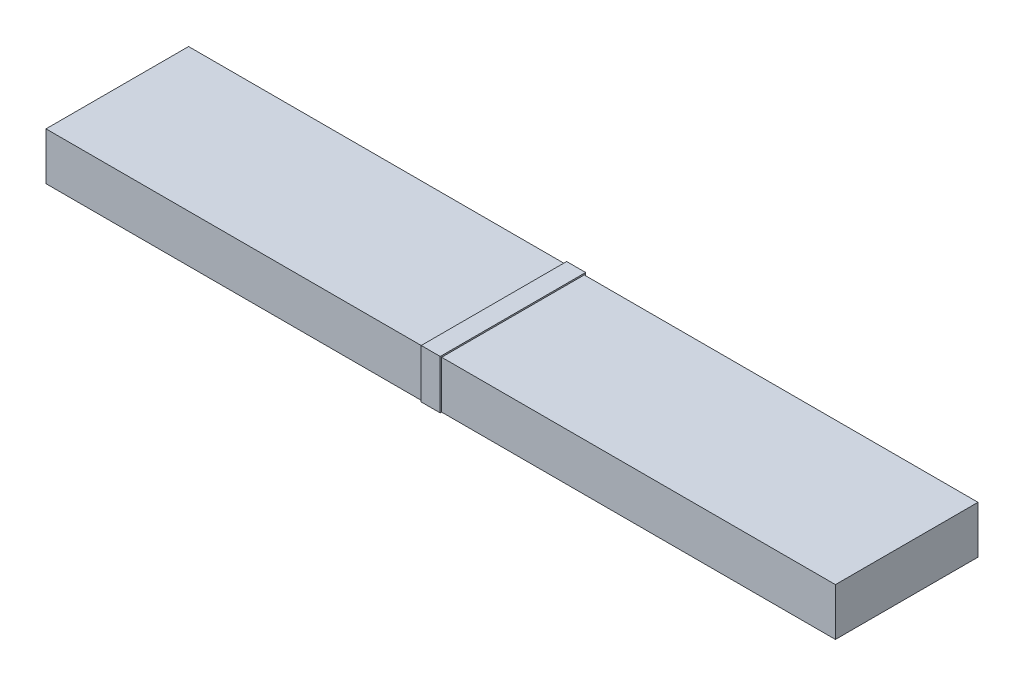
ISO-10303-21;
HEADER;
FILE_DESCRIPTION(('STEP AP214'),'2;1');
FILE_NAME('part.step','',(''),(''),'','','');
FILE_SCHEMA(('AUTOMOTIVE_DESIGN { 1 0 10303 214 1 1 1 1 }'));
ENDSEC;
DATA;
#1=APPLICATION_CONTEXT('core data for automotive mechanical design processes');
#2=APPLICATION_PROTOCOL_DEFINITION('international standard','automotive_design',2000,#1);
#3=PRODUCT_CONTEXT('',#1,'mechanical');
#4=PRODUCT('Part','Part','',(#3));
#5=PRODUCT_RELATED_PRODUCT_CATEGORY('part','',(#4));
#6=PRODUCT_DEFINITION_FORMATION('','',#4);
#7=PRODUCT_DEFINITION_CONTEXT('part definition',#1,'design');
#8=PRODUCT_DEFINITION('design','',#6,#7);
#9=PRODUCT_DEFINITION_SHAPE('','',#8);
#10=(LENGTH_UNIT() NAMED_UNIT(*) SI_UNIT(.MILLI.,.METRE.));
#11=(NAMED_UNIT(*) PLANE_ANGLE_UNIT() SI_UNIT($,.RADIAN.));
#12=(NAMED_UNIT(*) SI_UNIT($,.STERADIAN.) SOLID_ANGLE_UNIT());
#13=UNCERTAINTY_MEASURE_WITH_UNIT(LENGTH_MEASURE(1.E-05),#10,'distance_accuracy_value','');
#14=(GEOMETRIC_REPRESENTATION_CONTEXT(3) GLOBAL_UNCERTAINTY_ASSIGNED_CONTEXT((#13)) GLOBAL_UNIT_ASSIGNED_CONTEXT((#10,
#11,#12)) REPRESENTATION_CONTEXT('',''));
#15=CARTESIAN_POINT('',(0.,0.,0.));
#16=DIRECTION('',(0.,0.,1.));
#17=DIRECTION('',(1.,0.,0.));
#18=AXIS2_PLACEMENT_3D('',#15,#16,#17);
#19=CARTESIAN_POINT('',(-38.,-49.9999999999999,150.));
#20=DIRECTION('',(0.,-1.,0.));
#21=DIRECTION('',(0.,0.,-1.));
#22=AXIS2_PLACEMENT_3D('',#19,#20,#21);
#23=PLANE('',#22);
#24=DIRECTION('',(1.,0.,0.));
#25=VECTOR('',#24,1.);
#26=CARTESIAN_POINT('',(-38.,-49.9999999999999,150.));
#27=LINE('',#26,#25);
#28=CARTESIAN_POINT('',(-38.,-49.9999999999999,150.));
#29=VERTEX_POINT('',#28);
#30=CARTESIAN_POINT('',(2.,-49.9999999999999,150.));
#31=VERTEX_POINT('',#30);
#32=EDGE_CURVE('E48',#29,#31,#27,.T.);
#33=ORIENTED_EDGE('',*,*,#32,.T.);
#34=DIRECTION('',(0.,0.,-1.));
#35=VECTOR('',#34,1.);
#36=CARTESIAN_POINT('',(2.,-49.9999999999999,150.));
#37=LINE('',#36,#35);
#38=CARTESIAN_POINT('',(2.,-49.9999999999999,153.));
#39=VERTEX_POINT('',#38);
#40=EDGE_CURVE('E109',#39,#31,#37,.T.);
#41=ORIENTED_EDGE('',*,*,#40,.F.);
#42=DIRECTION('',(1.,0.,0.));
#43=VECTOR('',#42,1.);
#44=CARTESIAN_POINT('',(-38.,-49.9999999999999,153.));
#45=LINE('',#44,#43);
#46=CARTESIAN_POINT('',(-38.,-49.9999999999999,153.));
#47=VERTEX_POINT('',#46);
#48=EDGE_CURVE('E12',#47,#39,#45,.T.);
#49=ORIENTED_EDGE('',*,*,#48,.F.);
#50=DIRECTION('',(0.,0.,-1.));
#51=VECTOR('',#50,1.);
#52=CARTESIAN_POINT('',(-38.,-49.9999999999999,150.));
#53=LINE('',#52,#51);
#54=EDGE_CURVE('E110',#47,#29,#53,.T.);
#55=ORIENTED_EDGE('',*,*,#54,.T.);
#56=EDGE_LOOP('',(#33,#41,#49,#55));
#57=FACE_BOUND('',#56,.T.);
#58=ADVANCED_FACE('F45',(#57),#23,.T.);
#59=CARTESIAN_POINT('',(-38.,-49.9999999999999,153.));
#60=DIRECTION('',(0.,0.,1.));
#61=DIRECTION('',(1.,0.,0.));
#62=AXIS2_PLACEMENT_3D('',#59,#60,#61);
#63=PLANE('',#62);
#64=ORIENTED_EDGE('',*,*,#48,.T.);
#65=DIRECTION('',(0.,-1.,0.));
#66=VECTOR('',#65,1.);
#67=CARTESIAN_POINT('',(2.,-49.9999999999999,153.));
#68=LINE('',#67,#66);
#69=CARTESIAN_POINT('',(2.,53.,153.));
#70=VERTEX_POINT('',#69);
#71=EDGE_CURVE('E127',#70,#39,#68,.T.);
#72=ORIENTED_EDGE('',*,*,#71,.F.);
#73=DIRECTION('',(1.,0.,0.));
#74=VECTOR('',#73,1.);
#75=CARTESIAN_POINT('',(-38.,53.,153.));
#76=LINE('',#75,#74);
#77=CARTESIAN_POINT('',(-38.,53.,153.));
#78=VERTEX_POINT('',#77);
#79=EDGE_CURVE('E53',#78,#70,#76,.T.);
#80=ORIENTED_EDGE('',*,*,#79,.F.);
#81=DIRECTION('',(0.,-1.,0.));
#82=VECTOR('',#81,1.);
#83=CARTESIAN_POINT('',(-38.,-49.9999999999999,153.));
#84=LINE('',#83,#82);
#85=EDGE_CURVE('E115',#78,#47,#84,.T.);
#86=ORIENTED_EDGE('',*,*,#85,.T.);
#87=EDGE_LOOP('',(#64,#72,#80,#86));
#88=FACE_BOUND('',#87,.T.);
#89=ADVANCED_FACE('F191',(#88),#63,.T.);
#90=CARTESIAN_POINT('',(-38.,53.,153.));
#91=DIRECTION('',(0.,1.,0.));
#92=DIRECTION('',(0.,0.,1.));
#93=AXIS2_PLACEMENT_3D('',#90,#91,#92);
#94=PLANE('',#93);
#95=ORIENTED_EDGE('',*,*,#79,.T.);
#96=DIRECTION('',(0.,0.,1.));
#97=VECTOR('',#96,1.);
#98=CARTESIAN_POINT('',(2.,53.,153.));
#99=LINE('',#98,#97);
#100=CARTESIAN_POINT('',(2.,53.,-153.));
#101=VERTEX_POINT('',#100);
#102=EDGE_CURVE('E140',#101,#70,#99,.T.);
#103=ORIENTED_EDGE('',*,*,#102,.F.);
#104=DIRECTION('',(1.,0.,0.));
#105=VECTOR('',#104,1.);
#106=CARTESIAN_POINT('',(-38.,53.,-153.));
#107=LINE('',#106,#105);
#108=CARTESIAN_POINT('',(-38.,53.,-153.));
#109=VERTEX_POINT('',#108);
#110=EDGE_CURVE('E162',#109,#101,#107,.T.);
#111=ORIENTED_EDGE('',*,*,#110,.F.);
#112=DIRECTION('',(0.,0.,1.));
#113=VECTOR('',#112,1.);
#114=CARTESIAN_POINT('',(-38.,53.,153.));
#115=LINE('',#114,#113);
#116=EDGE_CURVE('E158',#109,#78,#115,.T.);
#117=ORIENTED_EDGE('',*,*,#116,.T.);
#118=EDGE_LOOP('',(#95,#103,#111,#117));
#119=FACE_BOUND('',#118,.T.);
#120=ADVANCED_FACE('F190',(#119),#94,.T.);
#121=CARTESIAN_POINT('',(-38.,53.,-153.));
#122=DIRECTION('',(0.,0.,-1.));
#123=DIRECTION('',(-1.,0.,0.));
#124=AXIS2_PLACEMENT_3D('',#121,#122,#123);
#125=PLANE('',#124);
#126=ORIENTED_EDGE('',*,*,#110,.T.);
#127=DIRECTION('',(0.,1.,0.));
#128=VECTOR('',#127,1.);
#129=CARTESIAN_POINT('',(2.,53.,-153.));
#130=LINE('',#129,#128);
#131=CARTESIAN_POINT('',(2.,-49.9999999999999,-153.));
#132=VERTEX_POINT('',#131);
#133=EDGE_CURVE('E137',#132,#101,#130,.T.);
#134=ORIENTED_EDGE('',*,*,#133,.F.);
#135=DIRECTION('',(1.,0.,0.));
#136=VECTOR('',#135,1.);
#137=CARTESIAN_POINT('',(-38.,-49.9999999999999,-153.));
#138=LINE('',#137,#136);
#139=CARTESIAN_POINT('',(-38.,-49.9999999999999,-153.));
#140=VERTEX_POINT('',#139);
#141=EDGE_CURVE('E164',#140,#132,#138,.T.);
#142=ORIENTED_EDGE('',*,*,#141,.F.);
#143=DIRECTION('',(0.,1.,0.));
#144=VECTOR('',#143,1.);
#145=CARTESIAN_POINT('',(-38.,53.,-153.));
#146=LINE('',#145,#144);
#147=EDGE_CURVE('E155',#140,#109,#146,.T.);
#148=ORIENTED_EDGE('',*,*,#147,.T.);
#149=EDGE_LOOP('',(#126,#134,#142,#148));
#150=FACE_BOUND('',#149,.T.);
#151=ADVANCED_FACE('F186',(#150),#125,.T.);
#152=CARTESIAN_POINT('',(-38.,-49.9999999999999,-150.));
#153=DIRECTION('',(0.,-1.,0.));
#154=DIRECTION('',(0.,0.,-1.));
#155=AXIS2_PLACEMENT_3D('',#152,#153,#154);
#156=PLANE('',#155);
#157=ORIENTED_EDGE('',*,*,#141,.T.);
#158=DIRECTION('',(0.,0.,-1.));
#159=VECTOR('',#158,1.);
#160=CARTESIAN_POINT('',(2.,-49.9999999999999,-150.));
#161=LINE('',#160,#159);
#162=CARTESIAN_POINT('',(2.,-49.9999999999999,-150.));
#163=VERTEX_POINT('',#162);
#164=EDGE_CURVE('E134',#163,#132,#161,.T.);
#165=ORIENTED_EDGE('',*,*,#164,.F.);
#166=DIRECTION('',(1.,0.,0.));
#167=VECTOR('',#166,1.);
#168=CARTESIAN_POINT('',(-38.,-49.9999999999999,-150.));
#169=LINE('',#168,#167);
#170=CARTESIAN_POINT('',(-38.,-49.9999999999999,-150.));
#171=VERTEX_POINT('',#170);
#172=EDGE_CURVE('E166',#171,#163,#169,.T.);
#173=ORIENTED_EDGE('',*,*,#172,.F.);
#174=DIRECTION('',(0.,0.,-1.));
#175=VECTOR('',#174,1.);
#176=CARTESIAN_POINT('',(-38.,-49.9999999999999,-150.));
#177=LINE('',#176,#175);
#178=EDGE_CURVE('E152',#171,#140,#177,.T.);
#179=ORIENTED_EDGE('',*,*,#178,.T.);
#180=EDGE_LOOP('',(#157,#165,#173,#179));
#181=FACE_BOUND('',#180,.T.);
#182=ADVANCED_FACE('F179',(#181),#156,.T.);
#183=CARTESIAN_POINT('',(-38.,50.,-150.));
#184=DIRECTION('',(0.,0.,1.));
#185=DIRECTION('',(1.,0.,0.));
#186=AXIS2_PLACEMENT_3D('',#183,#184,#185);
#187=PLANE('',#186);
#188=ORIENTED_EDGE('',*,*,#172,.T.);
#189=DIRECTION('',(0.,-1.,0.));
#190=VECTOR('',#189,1.);
#191=CARTESIAN_POINT('',(2.,50.,-150.));
#192=LINE('',#191,#190);
#193=CARTESIAN_POINT('',(2.,50.,-150.));
#194=VERTEX_POINT('',#193);
#195=EDGE_CURVE('E131',#194,#163,#192,.T.);
#196=ORIENTED_EDGE('',*,*,#195,.F.);
#197=DIRECTION('',(1.,0.,0.));
#198=VECTOR('',#197,1.);
#199=CARTESIAN_POINT('',(-38.,50.,-150.));
#200=LINE('',#199,#198);
#201=CARTESIAN_POINT('',(-38.,50.,-150.));
#202=VERTEX_POINT('',#201);
#203=EDGE_CURVE('E168',#202,#194,#200,.T.);
#204=ORIENTED_EDGE('',*,*,#203,.F.);
#205=DIRECTION('',(0.,-1.,0.));
#206=VECTOR('',#205,1.);
#207=CARTESIAN_POINT('',(-38.,50.,-150.));
#208=LINE('',#207,#206);
#209=EDGE_CURVE('E149',#202,#171,#208,.T.);
#210=ORIENTED_EDGE('',*,*,#209,.T.);
#211=EDGE_LOOP('',(#188,#196,#204,#210));
#212=FACE_BOUND('',#211,.T.);
#213=ADVANCED_FACE('F176',(#212),#187,.T.);
#214=CARTESIAN_POINT('',(-38.,50.,150.));
#215=DIRECTION('',(0.,-1.,0.));
#216=DIRECTION('',(0.,0.,-1.));
#217=AXIS2_PLACEMENT_3D('',#214,#215,#216);
#218=PLANE('',#217);
#219=ORIENTED_EDGE('',*,*,#203,.T.);
#220=DIRECTION('',(0.,0.,-1.));
#221=VECTOR('',#220,1.);
#222=CARTESIAN_POINT('',(2.,50.,150.));
#223=LINE('',#222,#221);
#224=CARTESIAN_POINT('',(2.,50.,150.));
#225=VERTEX_POINT('',#224);
#226=EDGE_CURVE('E122',#225,#194,#223,.T.);
#227=ORIENTED_EDGE('',*,*,#226,.F.);
#228=DIRECTION('',(1.,0.,0.));
#229=VECTOR('',#228,1.);
#230=CARTESIAN_POINT('',(-38.,50.,150.));
#231=LINE('',#230,#229);
#232=CARTESIAN_POINT('',(-38.,50.,150.));
#233=VERTEX_POINT('',#232);
#234=EDGE_CURVE('E114',#233,#225,#231,.T.);
#235=ORIENTED_EDGE('',*,*,#234,.F.);
#236=DIRECTION('',(0.,0.,-1.));
#237=VECTOR('',#236,1.);
#238=CARTESIAN_POINT('',(-38.,50.,150.));
#239=LINE('',#238,#237);
#240=EDGE_CURVE('E146',#233,#202,#239,.T.);
#241=ORIENTED_EDGE('',*,*,#240,.T.);
#242=EDGE_LOOP('',(#219,#227,#235,#241));
#243=FACE_BOUND('',#242,.T.);
#244=ADVANCED_FACE('F170',(#243),#218,.T.);
#245=CARTESIAN_POINT('',(-38.,-49.9999999999999,150.));
#246=DIRECTION('',(0.,0.,-1.));
#247=DIRECTION('',(-1.,0.,0.));
#248=AXIS2_PLACEMENT_3D('',#245,#246,#247);
#249=PLANE('',#248);
#250=ORIENTED_EDGE('',*,*,#234,.T.);
#251=DIRECTION('',(0.,1.,0.));
#252=VECTOR('',#251,1.);
#253=CARTESIAN_POINT('',(2.,-49.9999999999999,150.));
#254=LINE('',#253,#252);
#255=EDGE_CURVE('E117',#31,#225,#254,.T.);
#256=ORIENTED_EDGE('',*,*,#255,.F.);
#257=ORIENTED_EDGE('',*,*,#32,.F.);
#258=DIRECTION('',(0.,1.,0.));
#259=VECTOR('',#258,1.);
#260=CARTESIAN_POINT('',(-38.,-49.9999999999999,150.));
#261=LINE('',#260,#259);
#262=EDGE_CURVE('E144',#29,#233,#261,.T.);
#263=ORIENTED_EDGE('',*,*,#262,.T.);
#264=EDGE_LOOP('',(#250,#256,#257,#263));
#265=FACE_BOUND('',#264,.T.);
#266=ADVANCED_FACE('F118',(#265),#249,.T.);
#267=CARTESIAN_POINT('',(-38.,0.,0.));
#268=DIRECTION('',(-1.,0.,0.));
#269=DIRECTION('',(0.,0.,1.));
#270=AXIS2_PLACEMENT_3D('',#267,#268,#269);
#271=PLANE('',#270);
#272=ORIENTED_EDGE('',*,*,#54,.F.);
#273=ORIENTED_EDGE('',*,*,#85,.F.);
#274=ORIENTED_EDGE('',*,*,#116,.F.);
#275=ORIENTED_EDGE('',*,*,#147,.F.);
#276=ORIENTED_EDGE('',*,*,#178,.F.);
#277=ORIENTED_EDGE('',*,*,#209,.F.);
#278=ORIENTED_EDGE('',*,*,#240,.F.);
#279=ORIENTED_EDGE('',*,*,#262,.F.);
#280=EDGE_LOOP('',(#272,#273,#274,#275,#276,#277,#278,#279));
#281=FACE_BOUND('',#280,.T.);
#282=ADVANCED_FACE('F182',(#281),#271,.T.);
#283=CARTESIAN_POINT('',(2.,0.,0.));
#284=DIRECTION('',(-1.,0.,0.));
#285=DIRECTION('',(0.,0.,1.));
#286=AXIS2_PLACEMENT_3D('',#283,#284,#285);
#287=PLANE('',#286);
#288=ORIENTED_EDGE('',*,*,#40,.T.);
#289=ORIENTED_EDGE('',*,*,#255,.T.);
#290=ORIENTED_EDGE('',*,*,#226,.T.);
#291=ORIENTED_EDGE('',*,*,#195,.T.);
#292=ORIENTED_EDGE('',*,*,#164,.T.);
#293=ORIENTED_EDGE('',*,*,#133,.T.);
#294=ORIENTED_EDGE('',*,*,#102,.T.);
#295=ORIENTED_EDGE('',*,*,#71,.T.);
#296=EDGE_LOOP('',(#288,#289,#290,#291,#292,#293,#294,#295));
#297=FACE_BOUND('',#296,.T.);
#298=ADVANCED_FACE('F125',(#297),#287,.F.);
#299=CLOSED_SHELL('',(#58,#89,#120,#151,#182,#213,#244,#266,#282,#298));
#300=MANIFOLD_SOLID_BREP('B2',#299);
#301=CARTESIAN_POINT('',(830.5,-50.,-150.));
#302=DIRECTION('',(1.,0.,0.));
#303=DIRECTION('',(0.,0.,-1.));
#304=AXIS2_PLACEMENT_3D('',#301,#302,#303);
#305=PLANE('',#304);
#306=DIRECTION('',(0.,0.,1.));
#307=VECTOR('',#306,1.);
#308=CARTESIAN_POINT('',(830.5,50.,-150.));
#309=LINE('',#308,#307);
#310=CARTESIAN_POINT('',(830.5,50.,-150.));
#311=VERTEX_POINT('',#310);
#312=CARTESIAN_POINT('',(830.5,50.,150.));
#313=VERTEX_POINT('',#312);
#314=EDGE_CURVE('E276',#311,#313,#309,.T.);
#315=ORIENTED_EDGE('',*,*,#314,.T.);
#316=DIRECTION('',(0.,1.,0.));
#317=VECTOR('',#316,1.);
#318=CARTESIAN_POINT('',(830.5,-50.,150.));
#319=LINE('',#318,#317);
#320=CARTESIAN_POINT('',(830.5,-50.,150.));
#321=VERTEX_POINT('',#320);
#322=EDGE_CURVE('E313',#321,#313,#319,.T.);
#323=ORIENTED_EDGE('',*,*,#322,.F.);
#324=DIRECTION('',(0.,0.,1.));
#325=VECTOR('',#324,1.);
#326=CARTESIAN_POINT('',(830.5,-50.,-150.));
#327=LINE('',#326,#325);
#328=CARTESIAN_POINT('',(830.5,-50.,-150.));
#329=VERTEX_POINT('',#328);
#330=EDGE_CURVE('E43',#329,#321,#327,.T.);
#331=ORIENTED_EDGE('',*,*,#330,.F.);
#332=DIRECTION('',(0.,1.,0.));
#333=VECTOR('',#332,1.);
#334=CARTESIAN_POINT('',(830.5,-50.,-150.));
#335=LINE('',#334,#333);
#336=EDGE_CURVE('E314',#329,#311,#335,.T.);
#337=ORIENTED_EDGE('',*,*,#336,.T.);
#338=EDGE_LOOP('',(#315,#323,#331,#337));
#339=FACE_BOUND('',#338,.T.);
#340=ADVANCED_FACE('F273',(#339),#305,.T.);
#341=CARTESIAN_POINT('',(-830.5,-50.,-150.));
#342=DIRECTION('',(0.,-1.,0.));
#343=DIRECTION('',(0.,0.,-1.));
#344=AXIS2_PLACEMENT_3D('',#341,#342,#343);
#345=PLANE('',#344);
#346=ORIENTED_EDGE('',*,*,#330,.T.);
#347=DIRECTION('',(1.,0.,0.));
#348=VECTOR('',#347,1.);
#349=CARTESIAN_POINT('',(-830.5,-50.,150.));
#350=LINE('',#349,#348);
#351=CARTESIAN_POINT('',(-830.5,-50.,150.));
#352=VERTEX_POINT('',#351);
#353=EDGE_CURVE('E330',#352,#321,#350,.T.);
#354=ORIENTED_EDGE('',*,*,#353,.F.);
#355=DIRECTION('',(0.,0.,1.));
#356=VECTOR('',#355,1.);
#357=CARTESIAN_POINT('',(-830.5,-50.,-150.));
#358=LINE('',#357,#356);
#359=CARTESIAN_POINT('',(-830.5,-50.,-150.));
#360=VERTEX_POINT('',#359);
#361=EDGE_CURVE('E281',#360,#352,#358,.T.);
#362=ORIENTED_EDGE('',*,*,#361,.F.);
#363=DIRECTION('',(1.,0.,0.));
#364=VECTOR('',#363,1.);
#365=CARTESIAN_POINT('',(-830.5,-50.,-150.));
#366=LINE('',#365,#364);
#367=EDGE_CURVE('E319',#360,#329,#366,.T.);
#368=ORIENTED_EDGE('',*,*,#367,.T.);
#369=EDGE_LOOP('',(#346,#354,#362,#368));
#370=FACE_BOUND('',#369,.T.);
#371=ADVANCED_FACE('F345',(#370),#345,.T.);
#372=CARTESIAN_POINT('',(-830.5,-50.,-150.));
#373=DIRECTION('',(-1.,0.,0.));
#374=DIRECTION('',(0.,0.,1.));
#375=AXIS2_PLACEMENT_3D('',#372,#373,#374);
#376=PLANE('',#375);
#377=ORIENTED_EDGE('',*,*,#361,.T.);
#378=DIRECTION('',(0.,-1.,0.));
#379=VECTOR('',#378,1.);
#380=CARTESIAN_POINT('',(-830.5,-50.,150.));
#381=LINE('',#380,#379);
#382=CARTESIAN_POINT('',(-830.5,50.,150.));
#383=VERTEX_POINT('',#382);
#384=EDGE_CURVE('E326',#383,#352,#381,.T.);
#385=ORIENTED_EDGE('',*,*,#384,.F.);
#386=DIRECTION('',(0.,0.,1.));
#387=VECTOR('',#386,1.);
#388=CARTESIAN_POINT('',(-830.5,50.,-150.));
#389=LINE('',#388,#387);
#390=CARTESIAN_POINT('',(-830.5,50.,-150.));
#391=VERTEX_POINT('',#390);
#392=EDGE_CURVE('E318',#391,#383,#389,.T.);
#393=ORIENTED_EDGE('',*,*,#392,.F.);
#394=DIRECTION('',(0.,-1.,0.));
#395=VECTOR('',#394,1.);
#396=CARTESIAN_POINT('',(-830.5,-50.,-150.));
#397=LINE('',#396,#395);
#398=EDGE_CURVE('E338',#391,#360,#397,.T.);
#399=ORIENTED_EDGE('',*,*,#398,.T.);
#400=EDGE_LOOP('',(#377,#385,#393,#399));
#401=FACE_BOUND('',#400,.T.);
#402=ADVANCED_FACE('F342',(#401),#376,.T.);
#403=CARTESIAN_POINT('',(-830.5,50.,-150.));
#404=DIRECTION('',(0.,1.,0.));
#405=DIRECTION('',(0.,0.,1.));
#406=AXIS2_PLACEMENT_3D('',#403,#404,#405);
#407=PLANE('',#406);
#408=ORIENTED_EDGE('',*,*,#392,.T.);
#409=DIRECTION('',(-1.,0.,0.));
#410=VECTOR('',#409,1.);
#411=CARTESIAN_POINT('',(-830.5,50.,150.));
#412=LINE('',#411,#410);
#413=EDGE_CURVE('E321',#313,#383,#412,.T.);
#414=ORIENTED_EDGE('',*,*,#413,.F.);
#415=ORIENTED_EDGE('',*,*,#314,.F.);
#416=DIRECTION('',(-1.,0.,0.));
#417=VECTOR('',#416,1.);
#418=CARTESIAN_POINT('',(-830.5,50.,-150.));
#419=LINE('',#418,#417);
#420=EDGE_CURVE('E336',#311,#391,#419,.T.);
#421=ORIENTED_EDGE('',*,*,#420,.T.);
#422=EDGE_LOOP('',(#408,#414,#415,#421));
#423=FACE_BOUND('',#422,.T.);
#424=ADVANCED_FACE('F322',(#423),#407,.T.);
#425=CARTESIAN_POINT('',(0.,0.,-150.));
#426=DIRECTION('',(0.,0.,-1.));
#427=DIRECTION('',(-1.,0.,0.));
#428=AXIS2_PLACEMENT_3D('',#425,#426,#427);
#429=PLANE('',#428);
#430=ORIENTED_EDGE('',*,*,#336,.F.);
#431=ORIENTED_EDGE('',*,*,#367,.F.);
#432=ORIENTED_EDGE('',*,*,#398,.F.);
#433=ORIENTED_EDGE('',*,*,#420,.F.);
#434=EDGE_LOOP('',(#430,#431,#432,#433));
#435=FACE_BOUND('',#434,.T.);
#436=ADVANCED_FACE('F347',(#435),#429,.T.);
#437=CARTESIAN_POINT('',(0.,0.,150.));
#438=DIRECTION('',(0.,0.,-1.));
#439=DIRECTION('',(-1.,0.,0.));
#440=AXIS2_PLACEMENT_3D('',#437,#438,#439);
#441=PLANE('',#440);
#442=ORIENTED_EDGE('',*,*,#322,.T.);
#443=ORIENTED_EDGE('',*,*,#413,.T.);
#444=ORIENTED_EDGE('',*,*,#384,.T.);
#445=ORIENTED_EDGE('',*,*,#353,.T.);
#446=EDGE_LOOP('',(#442,#443,#444,#445));
#447=FACE_BOUND('',#446,.T.);
#448=ADVANCED_FACE('F329',(#447),#441,.F.);
#449=CLOSED_SHELL('',(#340,#371,#402,#424,#436,#448));
#450=MANIFOLD_SOLID_BREP('B6',#449);
#451=ADVANCED_BREP_SHAPE_REPRESENTATION('',(#18,#300,#450),#14);
#452=SHAPE_DEFINITION_REPRESENTATION(#9,#451);
ENDSEC;
END-ISO-10303-21;
